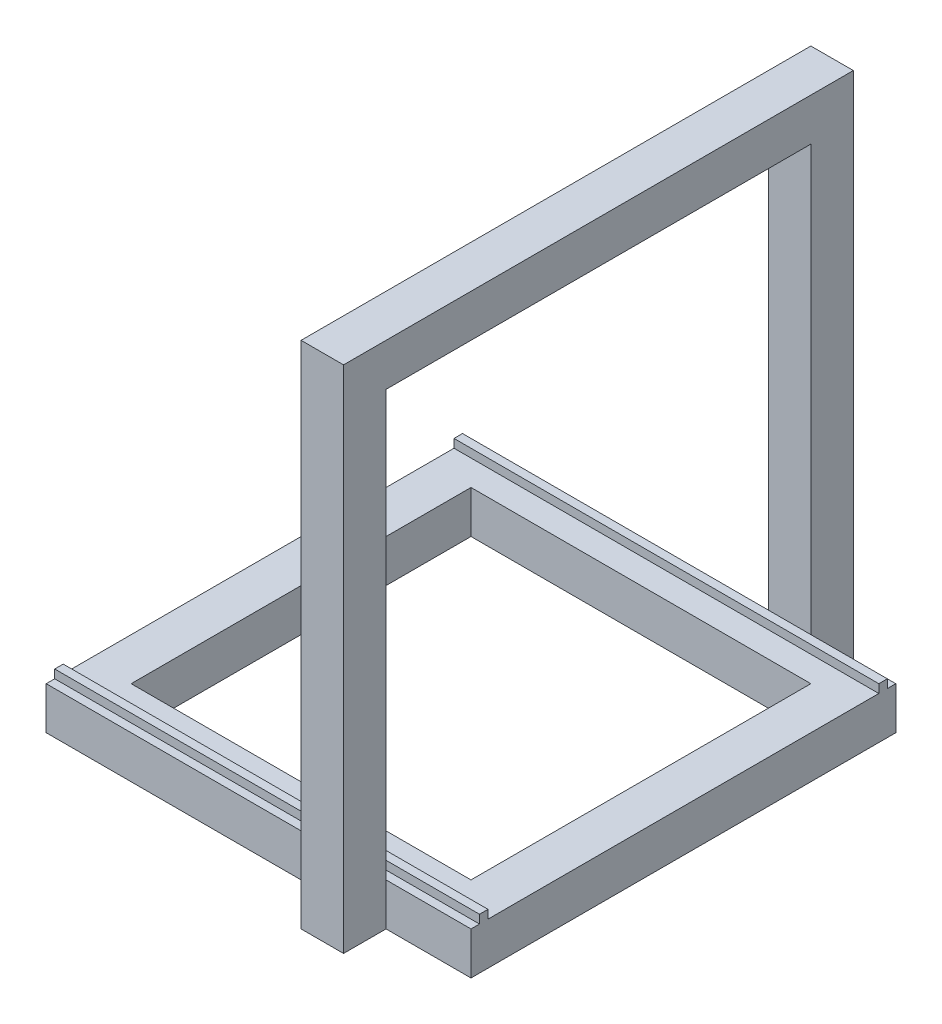
ISO-10303-21;
HEADER;
FILE_DESCRIPTION(('STEP AP214'),'2;1');
FILE_NAME('part.step','',(''),(''),'','','');
FILE_SCHEMA(('AUTOMOTIVE_DESIGN { 1 0 10303 214 1 1 1 1 }'));
ENDSEC;
DATA;
#1=APPLICATION_CONTEXT('core data for automotive mechanical design processes');
#2=APPLICATION_PROTOCOL_DEFINITION('international standard','automotive_design',2000,#1);
#3=PRODUCT_CONTEXT('',#1,'mechanical');
#4=PRODUCT('Part','Part','',(#3));
#5=PRODUCT_RELATED_PRODUCT_CATEGORY('part','',(#4));
#6=PRODUCT_DEFINITION_FORMATION('','',#4);
#7=PRODUCT_DEFINITION_CONTEXT('part definition',#1,'design');
#8=PRODUCT_DEFINITION('design','',#6,#7);
#9=PRODUCT_DEFINITION_SHAPE('','',#8);
#10=(LENGTH_UNIT() NAMED_UNIT(*) SI_UNIT(.MILLI.,.METRE.));
#11=(NAMED_UNIT(*) PLANE_ANGLE_UNIT() SI_UNIT($,.RADIAN.));
#12=(NAMED_UNIT(*) SI_UNIT($,.STERADIAN.) SOLID_ANGLE_UNIT());
#13=UNCERTAINTY_MEASURE_WITH_UNIT(LENGTH_MEASURE(1.E-05),#10,'distance_accuracy_value','');
#14=(GEOMETRIC_REPRESENTATION_CONTEXT(3) GLOBAL_UNCERTAINTY_ASSIGNED_CONTEXT((#13)) GLOBAL_UNIT_ASSIGNED_CONTEXT((#10,
#11,#12)) REPRESENTATION_CONTEXT('',''));
#15=CARTESIAN_POINT('',(0.,0.,0.));
#16=DIRECTION('',(0.,0.,1.));
#17=DIRECTION('',(1.,0.,0.));
#18=AXIS2_PLACEMENT_3D('',#15,#16,#17);
#19=CARTESIAN_POINT('',(-250.,50.,250.));
#20=DIRECTION('',(0.,0.,-1.));
#21=DIRECTION('',(-1.,0.,0.));
#22=AXIS2_PLACEMENT_3D('',#19,#20,#21);
#23=PLANE('',#22);
#24=DIRECTION('',(0.,-1.,0.));
#25=VECTOR('',#24,1.);
#26=CARTESIAN_POINT('',(99.9999999999999,550.,250.));
#27=LINE('',#26,#25);
#28=CARTESIAN_POINT('',(99.9999999999999,50.,250.));
#29=VERTEX_POINT('',#28);
#30=CARTESIAN_POINT('',(99.9999999999999,0.,250.));
#31=VERTEX_POINT('',#30);
#32=EDGE_CURVE('E11',#29,#31,#27,.T.);
#33=ORIENTED_EDGE('',*,*,#32,.F.);
#34=DIRECTION('',(1.,0.,0.));
#35=VECTOR('',#34,1.);
#36=CARTESIAN_POINT('',(-250.,50.,250.));
#37=LINE('',#36,#35);
#38=CARTESIAN_POINT('',(-250.,50.,250.));
#39=VERTEX_POINT('',#38);
#40=EDGE_CURVE('E332',#39,#29,#37,.T.);
#41=ORIENTED_EDGE('',*,*,#40,.F.);
#42=DIRECTION('',(0.,-1.,0.));
#43=VECTOR('',#42,1.);
#44=CARTESIAN_POINT('',(-250.,50.,250.));
#45=LINE('',#44,#43);
#46=CARTESIAN_POINT('',(-250.,0.,250.));
#47=VERTEX_POINT('',#46);
#48=EDGE_CURVE('E294',#39,#47,#45,.T.);
#49=ORIENTED_EDGE('',*,*,#48,.T.);
#50=DIRECTION('',(1.,0.,0.));
#51=VECTOR('',#50,1.);
#52=CARTESIAN_POINT('',(-250.,0.,250.));
#53=LINE('',#52,#51);
#54=EDGE_CURVE('E287',#47,#31,#53,.T.);
#55=ORIENTED_EDGE('',*,*,#54,.T.);
#56=EDGE_LOOP('',(#33,#41,#49,#55));
#57=FACE_BOUND('',#56,.T.);
#58=ADVANCED_FACE('F35',(#57),#23,.F.);
#59=CARTESIAN_POINT('',(-250.,50.,-250.));
#60=DIRECTION('',(0.,0.,-1.));
#61=DIRECTION('',(-1.,0.,0.));
#62=AXIS2_PLACEMENT_3D('',#59,#60,#61);
#63=PLANE('',#62);
#64=DIRECTION('',(1.,0.,0.));
#65=VECTOR('',#64,1.);
#66=CARTESIAN_POINT('',(-250.,50.,-250.));
#67=LINE('',#66,#65);
#68=CARTESIAN_POINT('',(-250.,50.,-250.));
#69=VERTEX_POINT('',#68);
#70=CARTESIAN_POINT('',(99.9999999999999,50.,-250.));
#71=VERTEX_POINT('',#70);
#72=EDGE_CURVE('E334',#69,#71,#67,.T.);
#73=ORIENTED_EDGE('',*,*,#72,.T.);
#74=DIRECTION('',(0.,-1.,0.));
#75=VECTOR('',#74,1.);
#76=CARTESIAN_POINT('',(99.9999999999999,550.,-250.));
#77=LINE('',#76,#75);
#78=CARTESIAN_POINT('',(99.9999999999999,0.,-250.));
#79=VERTEX_POINT('',#78);
#80=EDGE_CURVE('E346',#71,#79,#77,.T.);
#81=ORIENTED_EDGE('',*,*,#80,.T.);
#82=DIRECTION('',(1.,0.,0.));
#83=VECTOR('',#82,1.);
#84=CARTESIAN_POINT('',(-250.,0.,-250.));
#85=LINE('',#84,#83);
#86=CARTESIAN_POINT('',(-250.,0.,-250.));
#87=VERTEX_POINT('',#86);
#88=EDGE_CURVE('E320',#87,#79,#85,.T.);
#89=ORIENTED_EDGE('',*,*,#88,.F.);
#90=DIRECTION('',(0.,-1.,0.));
#91=VECTOR('',#90,1.);
#92=CARTESIAN_POINT('',(-250.,50.,-250.));
#93=LINE('',#92,#91);
#94=EDGE_CURVE('E362',#69,#87,#93,.T.);
#95=ORIENTED_EDGE('',*,*,#94,.F.);
#96=EDGE_LOOP('',(#73,#81,#89,#95));
#97=FACE_BOUND('',#96,.T.);
#98=ADVANCED_FACE('F461',(#97),#63,.T.);
#99=CARTESIAN_POINT('',(0.,50.,0.));
#100=DIRECTION('',(0.,1.,0.));
#101=DIRECTION('',(0.,0.,1.));
#102=AXIS2_PLACEMENT_3D('',#99,#100,#101);
#103=PLANE('',#102);
#104=DIRECTION('',(0.,0.,-1.));
#105=VECTOR('',#104,1.);
#106=CARTESIAN_POINT('',(250.,50.,250.));
#107=LINE('',#106,#105);
#108=CARTESIAN_POINT('',(250.,50.,250.));
#109=VERTEX_POINT('',#108);
#110=CARTESIAN_POINT('',(250.,50.,240.));
#111=VERTEX_POINT('',#110);
#112=EDGE_CURVE('E326',#109,#111,#107,.T.);
#113=ORIENTED_EDGE('',*,*,#112,.T.);
#114=DIRECTION('',(1.,0.,0.));
#115=VECTOR('',#114,1.);
#116=CARTESIAN_POINT('',(-250.,50.,240.));
#117=LINE('',#116,#115);
#118=CARTESIAN_POINT('',(-250.,50.,240.));
#119=VERTEX_POINT('',#118);
#120=EDGE_CURVE('E514',#119,#111,#117,.T.);
#121=ORIENTED_EDGE('',*,*,#120,.F.);
#122=DIRECTION('',(0.,0.,-1.));
#123=VECTOR('',#122,1.);
#124=CARTESIAN_POINT('',(-250.,50.,250.));
#125=LINE('',#124,#123);
#126=EDGE_CURVE('E363',#39,#119,#125,.T.);
#127=ORIENTED_EDGE('',*,*,#126,.F.);
#128=ORIENTED_EDGE('',*,*,#40,.T.);
#129=CARTESIAN_POINT('',(150.,50.,250.));
#130=VERTEX_POINT('',#129);
#131=EDGE_CURVE('E486',#29,#130,#37,.T.);
#132=ORIENTED_EDGE('',*,*,#131,.T.);
#133=EDGE_CURVE('E481',#130,#109,#37,.T.);
#134=ORIENTED_EDGE('',*,*,#133,.T.);
#135=EDGE_LOOP('',(#113,#121,#127,#128,#132,#134));
#136=FACE_BOUND('',#135,.T.);
#137=ADVANCED_FACE('F465',(#136),#103,.T.);
#138=DIRECTION('',(0.,0.,1.));
#139=VECTOR('',#138,1.);
#140=CARTESIAN_POINT('',(-200.,50.,-200.));
#141=LINE('',#140,#139);
#142=CARTESIAN_POINT('',(-200.,50.,-200.));
#143=VERTEX_POINT('',#142);
#144=CARTESIAN_POINT('',(-200.,50.,200.));
#145=VERTEX_POINT('',#144);
#146=EDGE_CURVE('E386',#143,#145,#141,.T.);
#147=ORIENTED_EDGE('',*,*,#146,.F.);
#148=DIRECTION('',(-1.,0.,0.));
#149=VECTOR('',#148,1.);
#150=CARTESIAN_POINT('',(200.,50.,-200.));
#151=LINE('',#150,#149);
#152=CARTESIAN_POINT('',(200.,50.,-200.));
#153=VERTEX_POINT('',#152);
#154=EDGE_CURVE('E427',#153,#143,#151,.T.);
#155=ORIENTED_EDGE('',*,*,#154,.F.);
#156=DIRECTION('',(0.,0.,-1.));
#157=VECTOR('',#156,1.);
#158=CARTESIAN_POINT('',(200.,50.,-200.));
#159=LINE('',#158,#157);
#160=CARTESIAN_POINT('',(200.,50.,200.));
#161=VERTEX_POINT('',#160);
#162=EDGE_CURVE('E422',#161,#153,#159,.T.);
#163=ORIENTED_EDGE('',*,*,#162,.F.);
#164=DIRECTION('',(1.,0.,0.));
#165=VECTOR('',#164,1.);
#166=CARTESIAN_POINT('',(200.,50.,200.));
#167=LINE('',#166,#165);
#168=EDGE_CURVE('E415',#145,#161,#167,.T.);
#169=ORIENTED_EDGE('',*,*,#168,.F.);
#170=EDGE_LOOP('',(#147,#155,#163,#169));
#171=FACE_BOUND('',#170,.T.);
#172=CARTESIAN_POINT('',(-250.,50.,230.));
#173=VERTEX_POINT('',#172);
#174=CARTESIAN_POINT('',(-250.,50.,-230.));
#175=VERTEX_POINT('',#174);
#176=EDGE_CURVE('E328',#173,#175,#125,.T.);
#177=ORIENTED_EDGE('',*,*,#176,.F.);
#178=DIRECTION('',(-1.,0.,0.));
#179=VECTOR('',#178,1.);
#180=CARTESIAN_POINT('',(-250.,50.,230.));
#181=LINE('',#180,#179);
#182=CARTESIAN_POINT('',(250.,50.,230.));
#183=VERTEX_POINT('',#182);
#184=EDGE_CURVE('E515',#183,#173,#181,.T.);
#185=ORIENTED_EDGE('',*,*,#184,.F.);
#186=CARTESIAN_POINT('',(250.,50.,-230.));
#187=VERTEX_POINT('',#186);
#188=EDGE_CURVE('E323',#183,#187,#107,.T.);
#189=ORIENTED_EDGE('',*,*,#188,.T.);
#190=DIRECTION('',(1.,0.,0.));
#191=VECTOR('',#190,1.);
#192=CARTESIAN_POINT('',(-250.,50.,-230.));
#193=LINE('',#192,#191);
#194=EDGE_CURVE('E371',#175,#187,#193,.T.);
#195=ORIENTED_EDGE('',*,*,#194,.F.);
#196=EDGE_LOOP('',(#177,#185,#189,#195));
#197=FACE_BOUND('',#196,.T.);
#198=ADVANCED_FACE('F439',(#171,#197),#103,.T.);
#199=DIRECTION('',(-1.,0.,0.));
#200=VECTOR('',#199,1.);
#201=CARTESIAN_POINT('',(-250.,50.,-240.));
#202=LINE('',#201,#200);
#203=CARTESIAN_POINT('',(250.,50.,-240.));
#204=VERTEX_POINT('',#203);
#205=CARTESIAN_POINT('',(-250.,50.,-240.));
#206=VERTEX_POINT('',#205);
#207=EDGE_CURVE('E375',#204,#206,#202,.T.);
#208=ORIENTED_EDGE('',*,*,#207,.F.);
#209=CARTESIAN_POINT('',(250.,50.,-250.));
#210=VERTEX_POINT('',#209);
#211=EDGE_CURVE('E327',#204,#210,#107,.T.);
#212=ORIENTED_EDGE('',*,*,#211,.T.);
#213=CARTESIAN_POINT('',(150.,50.,-250.));
#214=VERTEX_POINT('',#213);
#215=EDGE_CURVE('E342',#214,#210,#67,.T.);
#216=ORIENTED_EDGE('',*,*,#215,.F.);
#217=EDGE_CURVE('E500',#71,#214,#67,.T.);
#218=ORIENTED_EDGE('',*,*,#217,.F.);
#219=ORIENTED_EDGE('',*,*,#72,.F.);
#220=EDGE_CURVE('E368',#206,#69,#125,.T.);
#221=ORIENTED_EDGE('',*,*,#220,.F.);
#222=EDGE_LOOP('',(#208,#212,#216,#218,#219,#221));
#223=FACE_BOUND('',#222,.T.);
#224=ADVANCED_FACE('F471',(#223),#103,.T.);
#225=ORIENTED_EDGE('',*,*,#133,.F.);
#226=DIRECTION('',(0.,-1.,0.));
#227=VECTOR('',#226,1.);
#228=CARTESIAN_POINT('',(150.,550.,250.));
#229=LINE('',#228,#227);
#230=CARTESIAN_POINT('',(150.,0.,250.));
#231=VERTEX_POINT('',#230);
#232=EDGE_CURVE('E45',#130,#231,#229,.T.);
#233=ORIENTED_EDGE('',*,*,#232,.T.);
#234=CARTESIAN_POINT('',(250.,0.,250.));
#235=VERTEX_POINT('',#234);
#236=EDGE_CURVE('E296',#231,#235,#53,.T.);
#237=ORIENTED_EDGE('',*,*,#236,.T.);
#238=DIRECTION('',(0.,-1.,0.));
#239=VECTOR('',#238,1.);
#240=CARTESIAN_POINT('',(250.,50.,250.));
#241=LINE('',#240,#239);
#242=EDGE_CURVE('E356',#109,#235,#241,.T.);
#243=ORIENTED_EDGE('',*,*,#242,.F.);
#244=EDGE_LOOP('',(#225,#233,#237,#243));
#245=FACE_BOUND('',#244,.T.);
#246=ADVANCED_FACE('F37',(#245),#23,.F.);
#247=CARTESIAN_POINT('',(250.,50.,250.));
#248=DIRECTION('',(-1.,0.,0.));
#249=DIRECTION('',(0.,0.,1.));
#250=AXIS2_PLACEMENT_3D('',#247,#248,#249);
#251=PLANE('',#250);
#252=DIRECTION('',(0.,0.,-1.));
#253=VECTOR('',#252,1.);
#254=CARTESIAN_POINT('',(250.,0.,250.));
#255=LINE('',#254,#253);
#256=CARTESIAN_POINT('',(250.,0.,-250.));
#257=VERTEX_POINT('',#256);
#258=EDGE_CURVE('E295',#235,#257,#255,.T.);
#259=ORIENTED_EDGE('',*,*,#258,.T.);
#260=DIRECTION('',(0.,-1.,0.));
#261=VECTOR('',#260,1.);
#262=CARTESIAN_POINT('',(250.,50.,-250.));
#263=LINE('',#262,#261);
#264=EDGE_CURVE('E359',#210,#257,#263,.T.);
#265=ORIENTED_EDGE('',*,*,#264,.F.);
#266=ORIENTED_EDGE('',*,*,#211,.F.);
#267=DIRECTION('',(0.,-1.,0.));
#268=VECTOR('',#267,1.);
#269=CARTESIAN_POINT('',(250.,60.,-240.));
#270=LINE('',#269,#268);
#271=CARTESIAN_POINT('',(250.,60.,-240.));
#272=VERTEX_POINT('',#271);
#273=EDGE_CURVE('E398',#272,#204,#270,.T.);
#274=ORIENTED_EDGE('',*,*,#273,.F.);
#275=DIRECTION('',(0.,0.,-1.));
#276=VECTOR('',#275,1.);
#277=CARTESIAN_POINT('',(250.,60.,-240.));
#278=LINE('',#277,#276);
#279=CARTESIAN_POINT('',(250.,60.,-230.));
#280=VERTEX_POINT('',#279);
#281=EDGE_CURVE('E538',#280,#272,#278,.T.);
#282=ORIENTED_EDGE('',*,*,#281,.F.);
#283=DIRECTION('',(0.,-1.,0.));
#284=VECTOR('',#283,1.);
#285=CARTESIAN_POINT('',(250.,60.,-230.));
#286=LINE('',#285,#284);
#287=EDGE_CURVE('E377',#280,#187,#286,.T.);
#288=ORIENTED_EDGE('',*,*,#287,.T.);
#289=ORIENTED_EDGE('',*,*,#188,.F.);
#290=DIRECTION('',(0.,-1.,0.));
#291=VECTOR('',#290,1.);
#292=CARTESIAN_POINT('',(250.,60.,230.));
#293=LINE('',#292,#291);
#294=CARTESIAN_POINT('',(250.,60.,230.));
#295=VERTEX_POINT('',#294);
#296=EDGE_CURVE('E530',#295,#183,#293,.T.);
#297=ORIENTED_EDGE('',*,*,#296,.F.);
#298=DIRECTION('',(0.,0.,-1.));
#299=VECTOR('',#298,1.);
#300=CARTESIAN_POINT('',(250.,60.,230.));
#301=LINE('',#300,#299);
#302=CARTESIAN_POINT('',(250.,60.,240.));
#303=VERTEX_POINT('',#302);
#304=EDGE_CURVE('E851',#303,#295,#301,.T.);
#305=ORIENTED_EDGE('',*,*,#304,.F.);
#306=DIRECTION('',(0.,-1.,0.));
#307=VECTOR('',#306,1.);
#308=CARTESIAN_POINT('',(250.,60.,240.));
#309=LINE('',#308,#307);
#310=EDGE_CURVE('E532',#303,#111,#309,.T.);
#311=ORIENTED_EDGE('',*,*,#310,.T.);
#312=ORIENTED_EDGE('',*,*,#112,.F.);
#313=ORIENTED_EDGE('',*,*,#242,.T.);
#314=EDGE_LOOP('',(#259,#265,#266,#274,#282,#288,#289,#297,#305,#311,#312,#313));
#315=FACE_BOUND('',#314,.T.);
#316=ADVANCED_FACE('F470',(#315),#251,.F.);
#317=DIRECTION('',(0.,-1.,0.));
#318=VECTOR('',#317,1.);
#319=CARTESIAN_POINT('',(150.,550.,-250.));
#320=LINE('',#319,#318);
#321=CARTESIAN_POINT('',(150.,0.,-250.));
#322=VERTEX_POINT('',#321);
#323=EDGE_CURVE('E499',#214,#322,#320,.T.);
#324=ORIENTED_EDGE('',*,*,#323,.F.);
#325=ORIENTED_EDGE('',*,*,#215,.T.);
#326=ORIENTED_EDGE('',*,*,#264,.T.);
#327=EDGE_CURVE('E299',#322,#257,#85,.T.);
#328=ORIENTED_EDGE('',*,*,#327,.F.);
#329=EDGE_LOOP('',(#324,#325,#326,#328));
#330=FACE_BOUND('',#329,.T.);
#331=ADVANCED_FACE('F468',(#330),#63,.T.);
#332=CARTESIAN_POINT('',(-250.,50.,250.));
#333=DIRECTION('',(-1.,0.,0.));
#334=DIRECTION('',(0.,0.,1.));
#335=AXIS2_PLACEMENT_3D('',#332,#333,#334);
#336=PLANE('',#335);
#337=DIRECTION('',(0.,0.,-1.));
#338=VECTOR('',#337,1.);
#339=CARTESIAN_POINT('',(-250.,0.,250.));
#340=LINE('',#339,#338);
#341=EDGE_CURVE('E314',#47,#87,#340,.T.);
#342=ORIENTED_EDGE('',*,*,#341,.F.);
#343=ORIENTED_EDGE('',*,*,#48,.F.);
#344=ORIENTED_EDGE('',*,*,#126,.T.);
#345=DIRECTION('',(0.,-1.,0.));
#346=VECTOR('',#345,1.);
#347=CARTESIAN_POINT('',(-250.,60.,240.));
#348=LINE('',#347,#346);
#349=CARTESIAN_POINT('',(-250.,60.,240.));
#350=VERTEX_POINT('',#349);
#351=EDGE_CURVE('E376',#350,#119,#348,.T.);
#352=ORIENTED_EDGE('',*,*,#351,.F.);
#353=DIRECTION('',(0.,0.,1.));
#354=VECTOR('',#353,1.);
#355=CARTESIAN_POINT('',(-250.,60.,230.));
#356=LINE('',#355,#354);
#357=CARTESIAN_POINT('',(-250.,60.,230.));
#358=VERTEX_POINT('',#357);
#359=EDGE_CURVE('E521',#358,#350,#356,.T.);
#360=ORIENTED_EDGE('',*,*,#359,.F.);
#361=DIRECTION('',(0.,-1.,0.));
#362=VECTOR('',#361,1.);
#363=CARTESIAN_POINT('',(-250.,60.,230.));
#364=LINE('',#363,#362);
#365=EDGE_CURVE('E527',#358,#173,#364,.T.);
#366=ORIENTED_EDGE('',*,*,#365,.T.);
#367=ORIENTED_EDGE('',*,*,#176,.T.);
#368=DIRECTION('',(0.,-1.,0.));
#369=VECTOR('',#368,1.);
#370=CARTESIAN_POINT('',(-250.,60.,-230.));
#371=LINE('',#370,#369);
#372=CARTESIAN_POINT('',(-250.,60.,-230.));
#373=VERTEX_POINT('',#372);
#374=EDGE_CURVE('E407',#373,#175,#371,.T.);
#375=ORIENTED_EDGE('',*,*,#374,.F.);
#376=DIRECTION('',(0.,0.,1.));
#377=VECTOR('',#376,1.);
#378=CARTESIAN_POINT('',(-250.,60.,-240.));
#379=LINE('',#378,#377);
#380=CARTESIAN_POINT('',(-250.,60.,-240.));
#381=VERTEX_POINT('',#380);
#382=EDGE_CURVE('E392',#381,#373,#379,.T.);
#383=ORIENTED_EDGE('',*,*,#382,.F.);
#384=DIRECTION('',(0.,-1.,0.));
#385=VECTOR('',#384,1.);
#386=CARTESIAN_POINT('',(-250.,60.,-240.));
#387=LINE('',#386,#385);
#388=EDGE_CURVE('E395',#381,#206,#387,.T.);
#389=ORIENTED_EDGE('',*,*,#388,.T.);
#390=ORIENTED_EDGE('',*,*,#220,.T.);
#391=ORIENTED_EDGE('',*,*,#94,.T.);
#392=EDGE_LOOP('',(#342,#343,#344,#352,#360,#366,#367,#375,#383,#389,#390,#391));
#393=FACE_BOUND('',#392,.T.);
#394=ADVANCED_FACE('F544',(#393),#336,.T.);
#395=CARTESIAN_POINT('',(0.,0.,0.));
#396=DIRECTION('',(0.,1.,0.));
#397=DIRECTION('',(0.,0.,1.));
#398=AXIS2_PLACEMENT_3D('',#395,#396,#397);
#399=PLANE('',#398);
#400=DIRECTION('',(-1.,0.,0.));
#401=VECTOR('',#400,1.);
#402=CARTESIAN_POINT('',(0.,0.,-200.));
#403=LINE('',#402,#401);
#404=CARTESIAN_POINT('',(200.,0.,-200.));
#405=VERTEX_POINT('',#404);
#406=CARTESIAN_POINT('',(-200.,0.,-200.));
#407=VERTEX_POINT('',#406);
#408=EDGE_CURVE('E347',#405,#407,#403,.T.);
#409=ORIENTED_EDGE('',*,*,#408,.T.);
#410=DIRECTION('',(0.,0.,1.));
#411=VECTOR('',#410,1.);
#412=CARTESIAN_POINT('',(-200.,0.,0.));
#413=LINE('',#412,#411);
#414=CARTESIAN_POINT('',(-200.,0.,200.));
#415=VERTEX_POINT('',#414);
#416=EDGE_CURVE('E343',#407,#415,#413,.T.);
#417=ORIENTED_EDGE('',*,*,#416,.T.);
#418=DIRECTION('',(1.,0.,0.));
#419=VECTOR('',#418,1.);
#420=CARTESIAN_POINT('',(0.,0.,200.));
#421=LINE('',#420,#419);
#422=CARTESIAN_POINT('',(200.,0.,200.));
#423=VERTEX_POINT('',#422);
#424=EDGE_CURVE('E353',#415,#423,#421,.T.);
#425=ORIENTED_EDGE('',*,*,#424,.T.);
#426=DIRECTION('',(0.,0.,-1.));
#427=VECTOR('',#426,1.);
#428=CARTESIAN_POINT('',(200.,0.,0.));
#429=LINE('',#428,#427);
#430=EDGE_CURVE('E350',#423,#405,#429,.T.);
#431=ORIENTED_EDGE('',*,*,#430,.T.);
#432=EDGE_LOOP('',(#409,#417,#425,#431));
#433=FACE_BOUND('',#432,.T.);
#434=ORIENTED_EDGE('',*,*,#54,.F.);
#435=ORIENTED_EDGE('',*,*,#341,.T.);
#436=ORIENTED_EDGE('',*,*,#88,.T.);
#437=DIRECTION('',(0.,0.,-1.));
#438=VECTOR('',#437,1.);
#439=CARTESIAN_POINT('',(99.9999999999999,0.,-250.));
#440=LINE('',#439,#438);
#441=CARTESIAN_POINT('',(99.9999999999999,0.,-300.));
#442=VERTEX_POINT('',#441);
#443=EDGE_CURVE('E61',#79,#442,#440,.T.);
#444=ORIENTED_EDGE('',*,*,#443,.T.);
#445=DIRECTION('',(1.,0.,0.));
#446=VECTOR('',#445,1.);
#447=CARTESIAN_POINT('',(99.9999999999999,0.,-300.));
#448=LINE('',#447,#446);
#449=CARTESIAN_POINT('',(150.,0.,-300.));
#450=VERTEX_POINT('',#449);
#451=EDGE_CURVE('E838',#442,#450,#448,.T.);
#452=ORIENTED_EDGE('',*,*,#451,.T.);
#453=DIRECTION('',(0.,0.,1.));
#454=VECTOR('',#453,1.);
#455=CARTESIAN_POINT('',(150.,0.,-250.));
#456=LINE('',#455,#454);
#457=EDGE_CURVE('E215',#450,#322,#456,.T.);
#458=ORIENTED_EDGE('',*,*,#457,.T.);
#459=ORIENTED_EDGE('',*,*,#327,.T.);
#460=ORIENTED_EDGE('',*,*,#258,.F.);
#461=ORIENTED_EDGE('',*,*,#236,.F.);
#462=DIRECTION('',(0.,0.,1.));
#463=VECTOR('',#462,1.);
#464=CARTESIAN_POINT('',(150.,0.,250.));
#465=LINE('',#464,#463);
#466=CARTESIAN_POINT('',(150.,0.,300.));
#467=VERTEX_POINT('',#466);
#468=EDGE_CURVE('E53',#231,#467,#465,.T.);
#469=ORIENTED_EDGE('',*,*,#468,.T.);
#470=DIRECTION('',(-1.,0.,0.));
#471=VECTOR('',#470,1.);
#472=CARTESIAN_POINT('',(99.9999999999999,0.,300.));
#473=LINE('',#472,#471);
#474=CARTESIAN_POINT('',(99.9999999999999,0.,300.));
#475=VERTEX_POINT('',#474);
#476=EDGE_CURVE('E249',#467,#475,#473,.T.);
#477=ORIENTED_EDGE('',*,*,#476,.T.);
#478=DIRECTION('',(0.,0.,-1.));
#479=VECTOR('',#478,1.);
#480=CARTESIAN_POINT('',(99.9999999999999,0.,250.));
#481=LINE('',#480,#479);
#482=EDGE_CURVE('E240',#475,#31,#481,.T.);
#483=ORIENTED_EDGE('',*,*,#482,.T.);
#484=EDGE_LOOP('',(#434,#435,#436,#444,#452,#458,#459,#460,#461,#469,#477,#483));
#485=FACE_BOUND('',#484,.T.);
#486=ADVANCED_FACE('F285',(#433,#485),#399,.F.);
#487=CARTESIAN_POINT('',(-200.,-500.,-200.));
#488=DIRECTION('',(-1.,0.,0.));
#489=DIRECTION('',(0.,0.,1.));
#490=AXIS2_PLACEMENT_3D('',#487,#488,#489);
#491=PLANE('',#490);
#492=DIRECTION('',(0.,1.,0.));
#493=VECTOR('',#492,1.);
#494=CARTESIAN_POINT('',(-200.,-500.,-200.));
#495=LINE('',#494,#493);
#496=EDGE_CURVE('E301',#407,#143,#495,.T.);
#497=ORIENTED_EDGE('',*,*,#496,.T.);
#498=ORIENTED_EDGE('',*,*,#146,.T.);
#499=DIRECTION('',(0.,1.,0.));
#500=VECTOR('',#499,1.);
#501=CARTESIAN_POINT('',(-200.,-500.,200.));
#502=LINE('',#501,#500);
#503=EDGE_CURVE('E432',#415,#145,#502,.T.);
#504=ORIENTED_EDGE('',*,*,#503,.F.);
#505=ORIENTED_EDGE('',*,*,#416,.F.);
#506=EDGE_LOOP('',(#497,#498,#504,#505));
#507=FACE_BOUND('',#506,.T.);
#508=ADVANCED_FACE('F448',(#507),#491,.F.);
#509=CARTESIAN_POINT('',(200.,-500.,-200.));
#510=DIRECTION('',(0.,0.,-1.));
#511=DIRECTION('',(-1.,0.,0.));
#512=AXIS2_PLACEMENT_3D('',#509,#510,#511);
#513=PLANE('',#512);
#514=DIRECTION('',(0.,1.,0.));
#515=VECTOR('',#514,1.);
#516=CARTESIAN_POINT('',(200.,-500.,-200.));
#517=LINE('',#516,#515);
#518=EDGE_CURVE('E434',#405,#153,#517,.T.);
#519=ORIENTED_EDGE('',*,*,#518,.T.);
#520=ORIENTED_EDGE('',*,*,#154,.T.);
#521=ORIENTED_EDGE('',*,*,#496,.F.);
#522=ORIENTED_EDGE('',*,*,#408,.F.);
#523=EDGE_LOOP('',(#519,#520,#521,#522));
#524=FACE_BOUND('',#523,.T.);
#525=ADVANCED_FACE('F450',(#524),#513,.F.);
#526=CARTESIAN_POINT('',(200.,-500.,-200.));
#527=DIRECTION('',(1.,0.,0.));
#528=DIRECTION('',(0.,0.,-1.));
#529=AXIS2_PLACEMENT_3D('',#526,#527,#528);
#530=PLANE('',#529);
#531=DIRECTION('',(0.,1.,0.));
#532=VECTOR('',#531,1.);
#533=CARTESIAN_POINT('',(200.,-500.,200.));
#534=LINE('',#533,#532);
#535=EDGE_CURVE('E436',#423,#161,#534,.T.);
#536=ORIENTED_EDGE('',*,*,#535,.T.);
#537=ORIENTED_EDGE('',*,*,#162,.T.);
#538=ORIENTED_EDGE('',*,*,#518,.F.);
#539=ORIENTED_EDGE('',*,*,#430,.F.);
#540=EDGE_LOOP('',(#536,#537,#538,#539));
#541=FACE_BOUND('',#540,.T.);
#542=ADVANCED_FACE('F444',(#541),#530,.F.);
#543=CARTESIAN_POINT('',(200.,-500.,200.));
#544=DIRECTION('',(0.,0.,1.));
#545=DIRECTION('',(1.,0.,0.));
#546=AXIS2_PLACEMENT_3D('',#543,#544,#545);
#547=PLANE('',#546);
#548=ORIENTED_EDGE('',*,*,#503,.T.);
#549=ORIENTED_EDGE('',*,*,#168,.T.);
#550=ORIENTED_EDGE('',*,*,#535,.F.);
#551=ORIENTED_EDGE('',*,*,#424,.F.);
#552=EDGE_LOOP('',(#548,#549,#550,#551));
#553=FACE_BOUND('',#552,.T.);
#554=ADVANCED_FACE('F437',(#553),#547,.F.);
#555=CARTESIAN_POINT('',(-250.,60.,-230.));
#556=DIRECTION('',(0.,0.,-1.));
#557=DIRECTION('',(-1.,0.,0.));
#558=AXIS2_PLACEMENT_3D('',#555,#556,#557);
#559=PLANE('',#558);
#560=ORIENTED_EDGE('',*,*,#194,.T.);
#561=ORIENTED_EDGE('',*,*,#287,.F.);
#562=DIRECTION('',(1.,0.,0.));
#563=VECTOR('',#562,1.);
#564=CARTESIAN_POINT('',(-250.,60.,-230.));
#565=LINE('',#564,#563);
#566=EDGE_CURVE('E537',#373,#280,#565,.T.);
#567=ORIENTED_EDGE('',*,*,#566,.F.);
#568=ORIENTED_EDGE('',*,*,#374,.T.);
#569=EDGE_LOOP('',(#560,#561,#567,#568));
#570=FACE_BOUND('',#569,.T.);
#571=ADVANCED_FACE('F550',(#570),#559,.F.);
#572=CARTESIAN_POINT('',(-250.,60.,-240.));
#573=DIRECTION('',(0.,0.,1.));
#574=DIRECTION('',(1.,0.,0.));
#575=AXIS2_PLACEMENT_3D('',#572,#573,#574);
#576=PLANE('',#575);
#577=ORIENTED_EDGE('',*,*,#207,.T.);
#578=ORIENTED_EDGE('',*,*,#388,.F.);
#579=DIRECTION('',(-1.,0.,0.));
#580=VECTOR('',#579,1.);
#581=CARTESIAN_POINT('',(-250.,60.,-240.));
#582=LINE('',#581,#580);
#583=EDGE_CURVE('E382',#272,#381,#582,.T.);
#584=ORIENTED_EDGE('',*,*,#583,.F.);
#585=ORIENTED_EDGE('',*,*,#273,.T.);
#586=EDGE_LOOP('',(#577,#578,#584,#585));
#587=FACE_BOUND('',#586,.T.);
#588=ADVANCED_FACE('F543',(#587),#576,.F.);
#589=CARTESIAN_POINT('',(0.,60.,0.));
#590=DIRECTION('',(0.,1.,0.));
#591=DIRECTION('',(0.,0.,1.));
#592=AXIS2_PLACEMENT_3D('',#589,#590,#591);
#593=PLANE('',#592);
#594=ORIENTED_EDGE('',*,*,#382,.T.);
#595=ORIENTED_EDGE('',*,*,#566,.T.);
#596=ORIENTED_EDGE('',*,*,#281,.T.);
#597=ORIENTED_EDGE('',*,*,#583,.T.);
#598=EDGE_LOOP('',(#594,#595,#596,#597));
#599=FACE_BOUND('',#598,.T.);
#600=ADVANCED_FACE('F541',(#599),#593,.T.);
#601=CARTESIAN_POINT('',(-250.,60.,240.));
#602=DIRECTION('',(0.,0.,-1.));
#603=DIRECTION('',(-1.,0.,0.));
#604=AXIS2_PLACEMENT_3D('',#601,#602,#603);
#605=PLANE('',#604);
#606=ORIENTED_EDGE('',*,*,#120,.T.);
#607=ORIENTED_EDGE('',*,*,#310,.F.);
#608=DIRECTION('',(1.,0.,0.));
#609=VECTOR('',#608,1.);
#610=CARTESIAN_POINT('',(-250.,60.,240.));
#611=LINE('',#610,#609);
#612=EDGE_CURVE('E850',#350,#303,#611,.T.);
#613=ORIENTED_EDGE('',*,*,#612,.F.);
#614=ORIENTED_EDGE('',*,*,#351,.T.);
#615=EDGE_LOOP('',(#606,#607,#613,#614));
#616=FACE_BOUND('',#615,.T.);
#617=ADVANCED_FACE('F561',(#616),#605,.F.);
#618=CARTESIAN_POINT('',(-250.,60.,230.));
#619=DIRECTION('',(0.,0.,1.));
#620=DIRECTION('',(1.,0.,0.));
#621=AXIS2_PLACEMENT_3D('',#618,#619,#620);
#622=PLANE('',#621);
#623=ORIENTED_EDGE('',*,*,#184,.T.);
#624=ORIENTED_EDGE('',*,*,#365,.F.);
#625=DIRECTION('',(-1.,0.,0.));
#626=VECTOR('',#625,1.);
#627=CARTESIAN_POINT('',(-250.,60.,230.));
#628=LINE('',#627,#626);
#629=EDGE_CURVE('E524',#295,#358,#628,.T.);
#630=ORIENTED_EDGE('',*,*,#629,.F.);
#631=ORIENTED_EDGE('',*,*,#296,.T.);
#632=EDGE_LOOP('',(#623,#624,#630,#631));
#633=FACE_BOUND('',#632,.T.);
#634=ADVANCED_FACE('F564',(#633),#622,.F.);
#635=CARTESIAN_POINT('',(0.,60.,0.));
#636=DIRECTION('',(0.,1.,0.));
#637=DIRECTION('',(0.,0.,1.));
#638=AXIS2_PLACEMENT_3D('',#635,#636,#637);
#639=PLANE('',#638);
#640=ORIENTED_EDGE('',*,*,#359,.T.);
#641=ORIENTED_EDGE('',*,*,#612,.T.);
#642=ORIENTED_EDGE('',*,*,#304,.T.);
#643=ORIENTED_EDGE('',*,*,#629,.T.);
#644=EDGE_LOOP('',(#640,#641,#642,#643));
#645=FACE_BOUND('',#644,.T.);
#646=ADVANCED_FACE('F567',(#645),#639,.T.);
#647=CARTESIAN_POINT('',(99.9999999999999,550.,-250.));
#648=DIRECTION('',(-1.,0.,0.));
#649=DIRECTION('',(0.,0.,1.));
#650=AXIS2_PLACEMENT_3D('',#647,#648,#649);
#651=PLANE('',#650);
#652=ORIENTED_EDGE('',*,*,#443,.F.);
#653=ORIENTED_EDGE('',*,*,#80,.F.);
#654=CARTESIAN_POINT('',(99.9999999999999,550.,-250.));
#655=VERTEX_POINT('',#654);
#656=EDGE_CURVE('E263',#655,#71,#77,.T.);
#657=ORIENTED_EDGE('',*,*,#656,.F.);
#658=DIRECTION('',(0.,0.,1.));
#659=VECTOR('',#658,1.);
#660=CARTESIAN_POINT('',(99.9999999999999,550.,-300.));
#661=LINE('',#660,#659);
#662=CARTESIAN_POINT('',(99.9999999999999,550.,250.));
#663=VERTEX_POINT('',#662);
#664=EDGE_CURVE('E234',#655,#663,#661,.T.);
#665=ORIENTED_EDGE('',*,*,#664,.T.);
#666=EDGE_CURVE('E256',#663,#29,#27,.T.);
#667=ORIENTED_EDGE('',*,*,#666,.T.);
#668=ORIENTED_EDGE('',*,*,#32,.T.);
#669=ORIENTED_EDGE('',*,*,#482,.F.);
#670=DIRECTION('',(0.,-1.,0.));
#671=VECTOR('',#670,1.);
#672=CARTESIAN_POINT('',(99.9999999999999,550.,300.));
#673=LINE('',#672,#671);
#674=CARTESIAN_POINT('',(99.9999999999999,600.,300.));
#675=VERTEX_POINT('',#674);
#676=EDGE_CURVE('E843',#675,#475,#673,.T.);
#677=ORIENTED_EDGE('',*,*,#676,.F.);
#678=DIRECTION('',(0.,0.,1.));
#679=VECTOR('',#678,1.);
#680=CARTESIAN_POINT('',(99.9999999999999,600.,-300.));
#681=LINE('',#680,#679);
#682=CARTESIAN_POINT('',(99.9999999999999,600.,-300.));
#683=VERTEX_POINT('',#682);
#684=EDGE_CURVE('E229',#683,#675,#681,.T.);
#685=ORIENTED_EDGE('',*,*,#684,.F.);
#686=DIRECTION('',(0.,-1.,0.));
#687=VECTOR('',#686,1.);
#688=CARTESIAN_POINT('',(99.9999999999999,550.,-300.));
#689=LINE('',#688,#687);
#690=EDGE_CURVE('E220',#683,#442,#689,.T.);
#691=ORIENTED_EDGE('',*,*,#690,.T.);
#692=EDGE_LOOP('',(#652,#653,#657,#665,#667,#668,#669,#677,#685,#691));
#693=FACE_BOUND('',#692,.T.);
#694=ADVANCED_FACE('F571',(#693),#651,.T.);
#695=CARTESIAN_POINT('',(99.9999999999999,550.,-250.));
#696=DIRECTION('',(0.,0.,1.));
#697=DIRECTION('',(1.,0.,0.));
#698=AXIS2_PLACEMENT_3D('',#695,#696,#697);
#699=PLANE('',#698);
#700=ORIENTED_EDGE('',*,*,#656,.T.);
#701=ORIENTED_EDGE('',*,*,#217,.T.);
#702=CARTESIAN_POINT('',(150.,550.,-250.));
#703=VERTEX_POINT('',#702);
#704=EDGE_CURVE('E39',#703,#214,#320,.T.);
#705=ORIENTED_EDGE('',*,*,#704,.F.);
#706=DIRECTION('',(-1.,0.,0.));
#707=VECTOR('',#706,1.);
#708=CARTESIAN_POINT('',(99.9999999999999,550.,-250.));
#709=LINE('',#708,#707);
#710=EDGE_CURVE('E836',#703,#655,#709,.T.);
#711=ORIENTED_EDGE('',*,*,#710,.T.);
#712=EDGE_LOOP('',(#700,#701,#705,#711));
#713=FACE_BOUND('',#712,.T.);
#714=ADVANCED_FACE('F509',(#713),#699,.T.);
#715=CARTESIAN_POINT('',(150.,550.,-250.));
#716=DIRECTION('',(1.,0.,0.));
#717=DIRECTION('',(0.,0.,-1.));
#718=AXIS2_PLACEMENT_3D('',#715,#716,#717);
#719=PLANE('',#718);
#720=ORIENTED_EDGE('',*,*,#457,.F.);
#721=DIRECTION('',(0.,-1.,0.));
#722=VECTOR('',#721,1.);
#723=CARTESIAN_POINT('',(150.,550.,-300.));
#724=LINE('',#723,#722);
#725=CARTESIAN_POINT('',(150.,600.,-300.));
#726=VERTEX_POINT('',#725);
#727=EDGE_CURVE('E209',#726,#450,#724,.T.);
#728=ORIENTED_EDGE('',*,*,#727,.F.);
#729=DIRECTION('',(0.,0.,1.));
#730=VECTOR('',#729,1.);
#731=CARTESIAN_POINT('',(150.,600.,-300.));
#732=LINE('',#731,#730);
#733=CARTESIAN_POINT('',(150.,600.,300.));
#734=VERTEX_POINT('',#733);
#735=EDGE_CURVE('E212',#726,#734,#732,.T.);
#736=ORIENTED_EDGE('',*,*,#735,.T.);
#737=DIRECTION('',(0.,-1.,0.));
#738=VECTOR('',#737,1.);
#739=CARTESIAN_POINT('',(150.,550.,300.));
#740=LINE('',#739,#738);
#741=EDGE_CURVE('E856',#734,#467,#740,.T.);
#742=ORIENTED_EDGE('',*,*,#741,.T.);
#743=ORIENTED_EDGE('',*,*,#468,.F.);
#744=ORIENTED_EDGE('',*,*,#232,.F.);
#745=CARTESIAN_POINT('',(150.,550.,250.));
#746=VERTEX_POINT('',#745);
#747=EDGE_CURVE('E257',#746,#130,#229,.T.);
#748=ORIENTED_EDGE('',*,*,#747,.F.);
#749=DIRECTION('',(0.,0.,1.));
#750=VECTOR('',#749,1.);
#751=CARTESIAN_POINT('',(150.,550.,-300.));
#752=LINE('',#751,#750);
#753=EDGE_CURVE('E230',#703,#746,#752,.T.);
#754=ORIENTED_EDGE('',*,*,#753,.F.);
#755=ORIENTED_EDGE('',*,*,#704,.T.);
#756=ORIENTED_EDGE('',*,*,#323,.T.);
#757=EDGE_LOOP('',(#720,#728,#736,#742,#743,#744,#748,#754,#755,#756));
#758=FACE_BOUND('',#757,.T.);
#759=ADVANCED_FACE('F211',(#758),#719,.T.);
#760=CARTESIAN_POINT('',(99.9999999999999,550.,-300.));
#761=DIRECTION('',(0.,0.,-1.));
#762=DIRECTION('',(-1.,0.,0.));
#763=AXIS2_PLACEMENT_3D('',#760,#761,#762);
#764=PLANE('',#763);
#765=ORIENTED_EDGE('',*,*,#451,.F.);
#766=ORIENTED_EDGE('',*,*,#690,.F.);
#767=DIRECTION('',(-1.,0.,0.));
#768=VECTOR('',#767,1.);
#769=CARTESIAN_POINT('',(99.9999999999999,600.,-300.));
#770=LINE('',#769,#768);
#771=EDGE_CURVE('E226',#726,#683,#770,.T.);
#772=ORIENTED_EDGE('',*,*,#771,.F.);
#773=ORIENTED_EDGE('',*,*,#727,.T.);
#774=EDGE_LOOP('',(#765,#766,#772,#773));
#775=FACE_BOUND('',#774,.T.);
#776=ADVANCED_FACE('F232',(#775),#764,.T.);
#777=CARTESIAN_POINT('',(99.9999999999999,550.,250.));
#778=DIRECTION('',(0.,0.,-1.));
#779=DIRECTION('',(-1.,0.,0.));
#780=AXIS2_PLACEMENT_3D('',#777,#778,#779);
#781=PLANE('',#780);
#782=ORIENTED_EDGE('',*,*,#131,.F.);
#783=ORIENTED_EDGE('',*,*,#666,.F.);
#784=DIRECTION('',(1.,0.,0.));
#785=VECTOR('',#784,1.);
#786=CARTESIAN_POINT('',(99.9999999999999,550.,250.));
#787=LINE('',#786,#785);
#788=EDGE_CURVE('E252',#663,#746,#787,.T.);
#789=ORIENTED_EDGE('',*,*,#788,.T.);
#790=ORIENTED_EDGE('',*,*,#747,.T.);
#791=EDGE_LOOP('',(#782,#783,#789,#790));
#792=FACE_BOUND('',#791,.T.);
#793=ADVANCED_FACE('F577',(#792),#781,.T.);
#794=CARTESIAN_POINT('',(99.9999999999999,550.,300.));
#795=DIRECTION('',(0.,0.,1.));
#796=DIRECTION('',(1.,0.,0.));
#797=AXIS2_PLACEMENT_3D('',#794,#795,#796);
#798=PLANE('',#797);
#799=ORIENTED_EDGE('',*,*,#476,.F.);
#800=ORIENTED_EDGE('',*,*,#741,.F.);
#801=DIRECTION('',(-1.,0.,0.));
#802=VECTOR('',#801,1.);
#803=CARTESIAN_POINT('',(99.9999999999999,600.,300.));
#804=LINE('',#803,#802);
#805=EDGE_CURVE('E228',#734,#675,#804,.T.);
#806=ORIENTED_EDGE('',*,*,#805,.T.);
#807=ORIENTED_EDGE('',*,*,#676,.T.);
#808=EDGE_LOOP('',(#799,#800,#806,#807));
#809=FACE_BOUND('',#808,.T.);
#810=ADVANCED_FACE('F584',(#809),#798,.T.);
#811=CARTESIAN_POINT('',(99.9999999999999,550.,-300.));
#812=DIRECTION('',(0.,-1.,0.));
#813=DIRECTION('',(0.,0.,-1.));
#814=AXIS2_PLACEMENT_3D('',#811,#812,#813);
#815=PLANE('',#814);
#816=ORIENTED_EDGE('',*,*,#710,.F.);
#817=ORIENTED_EDGE('',*,*,#753,.T.);
#818=ORIENTED_EDGE('',*,*,#788,.F.);
#819=ORIENTED_EDGE('',*,*,#664,.F.);
#820=EDGE_LOOP('',(#816,#817,#818,#819));
#821=FACE_BOUND('',#820,.T.);
#822=ADVANCED_FACE('F587',(#821),#815,.T.);
#823=CARTESIAN_POINT('',(99.9999999999999,600.,-300.));
#824=DIRECTION('',(0.,1.,0.));
#825=DIRECTION('',(0.,0.,1.));
#826=AXIS2_PLACEMENT_3D('',#823,#824,#825);
#827=PLANE('',#826);
#828=ORIENTED_EDGE('',*,*,#805,.F.);
#829=ORIENTED_EDGE('',*,*,#735,.F.);
#830=ORIENTED_EDGE('',*,*,#771,.T.);
#831=ORIENTED_EDGE('',*,*,#684,.T.);
#832=EDGE_LOOP('',(#828,#829,#830,#831));
#833=FACE_BOUND('',#832,.T.);
#834=ADVANCED_FACE('F224',(#833),#827,.T.);
#835=CLOSED_SHELL('',(#58,#98,#137,#198,#224,#246,#316,#331,#394,#486,#508,#525,#542,#554,#571,
#588,#600,#617,#634,#646,#694,#714,#759,#776,#793,#810,#822,#834));
#836=MANIFOLD_SOLID_BREP('B2',#835);
#837=ADVANCED_BREP_SHAPE_REPRESENTATION('',(#18,#836),#14);
#838=SHAPE_DEFINITION_REPRESENTATION(#9,#837);
ENDSEC;
END-ISO-10303-21;
